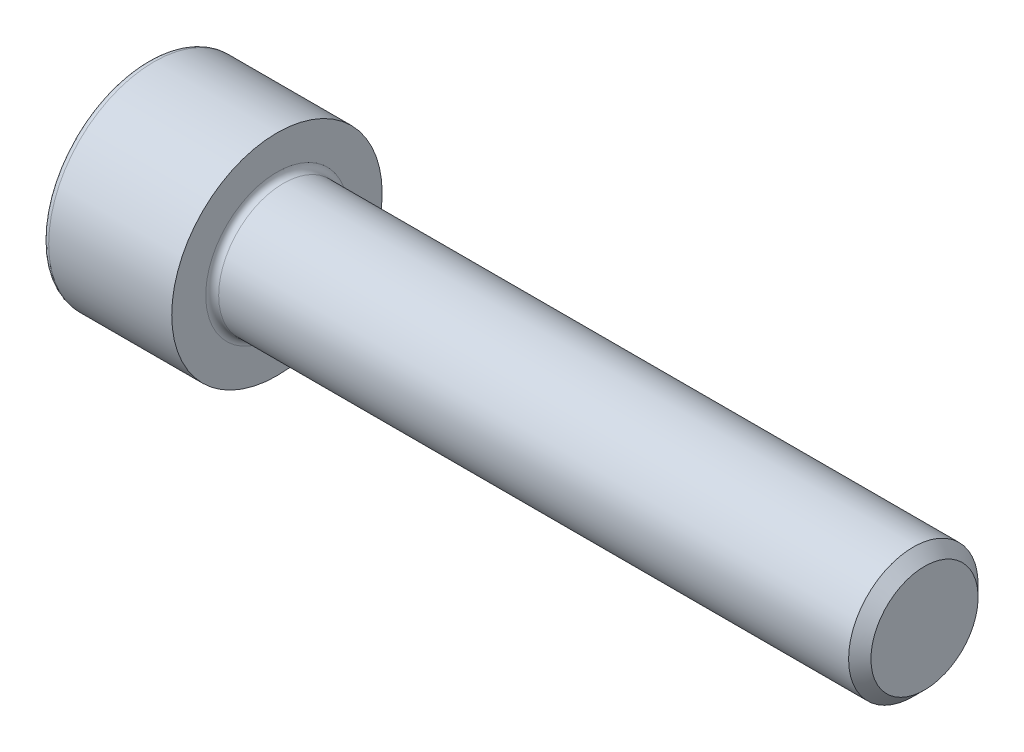
ISO-10303-21;
HEADER;
FILE_DESCRIPTION(('STEP AP214'),'2;1');
FILE_NAME('part.step','',(''),(''),'','','');
FILE_SCHEMA(('AUTOMOTIVE_DESIGN { 1 0 10303 214 1 1 1 1 }'));
ENDSEC;
DATA;
#1=APPLICATION_CONTEXT('core data for automotive mechanical design processes');
#2=APPLICATION_PROTOCOL_DEFINITION('international standard','automotive_design',2000,#1);
#3=PRODUCT_CONTEXT('',#1,'mechanical');
#4=PRODUCT('Part','Part','',(#3));
#5=PRODUCT_RELATED_PRODUCT_CATEGORY('part','',(#4));
#6=PRODUCT_DEFINITION_FORMATION('','',#4);
#7=PRODUCT_DEFINITION_CONTEXT('part definition',#1,'design');
#8=PRODUCT_DEFINITION('design','',#6,#7);
#9=PRODUCT_DEFINITION_SHAPE('','',#8);
#10=(LENGTH_UNIT() NAMED_UNIT(*) SI_UNIT(.MILLI.,.METRE.));
#11=(NAMED_UNIT(*) PLANE_ANGLE_UNIT() SI_UNIT($,.RADIAN.));
#12=(NAMED_UNIT(*) SI_UNIT($,.STERADIAN.) SOLID_ANGLE_UNIT());
#13=UNCERTAINTY_MEASURE_WITH_UNIT(LENGTH_MEASURE(1.E-05),#10,'distance_accuracy_value','');
#14=(GEOMETRIC_REPRESENTATION_CONTEXT(3) GLOBAL_UNCERTAINTY_ASSIGNED_CONTEXT((#13)) GLOBAL_UNIT_ASSIGNED_CONTEXT((#10,
#11,#12)) REPRESENTATION_CONTEXT('',''));
#15=CARTESIAN_POINT('',(0.,0.,0.));
#16=DIRECTION('',(0.,0.,1.));
#17=DIRECTION('',(1.,0.,0.));
#18=AXIS2_PLACEMENT_3D('',#15,#16,#17);
#19=CARTESIAN_POINT('',(0.,0.,0.));
#20=DIRECTION('',(-1.,0.,0.));
#21=DIRECTION('',(0.,0.,1.));
#22=AXIS2_PLACEMENT_3D('',#19,#20,#21);
#23=PLANE('',#22);
#24=DIRECTION('',(0.,-0.499999999999999,0.866025403784439));
#25=VECTOR('',#24,1.);
#26=CARTESIAN_POINT('',(0.,3.51894989071077,0.));
#27=LINE('',#26,#25);
#28=CARTESIAN_POINT('',(0.,3.51894989071077,0.));
#29=VERTEX_POINT('',#28);
#30=CARTESIAN_POINT('',(0.,1.75947494535538,3.0475));
#31=VERTEX_POINT('',#30);
#32=EDGE_CURVE('E258',#29,#31,#27,.T.);
#33=ORIENTED_EDGE('',*,*,#32,.T.);
#34=DIRECTION('',(0.,1.,0.));
#35=VECTOR('',#34,1.);
#36=CARTESIAN_POINT('',(0.,-1.75947494535539,3.0475));
#37=LINE('',#36,#35);
#38=CARTESIAN_POINT('',(0.,-1.75947494535539,3.0475));
#39=VERTEX_POINT('',#38);
#40=EDGE_CURVE('E130',#39,#31,#37,.T.);
#41=ORIENTED_EDGE('',*,*,#40,.F.);
#42=DIRECTION('',(0.,-0.500000000000001,-0.866025403784438));
#43=VECTOR('',#42,1.);
#44=CARTESIAN_POINT('',(0.,-1.75947494535539,3.0475));
#45=LINE('',#44,#43);
#46=CARTESIAN_POINT('',(0.,-3.51894989071077,0.));
#47=VERTEX_POINT('',#46);
#48=EDGE_CURVE('E261',#39,#47,#45,.T.);
#49=ORIENTED_EDGE('',*,*,#48,.T.);
#50=DIRECTION('',(0.,0.499999999999999,-0.866025403784439));
#51=VECTOR('',#50,1.);
#52=CARTESIAN_POINT('',(0.,-3.51894989071077,0.));
#53=LINE('',#52,#51);
#54=CARTESIAN_POINT('',(0.,-1.75947494535539,-3.0475));
#55=VERTEX_POINT('',#54);
#56=EDGE_CURVE('E264',#47,#55,#53,.T.);
#57=ORIENTED_EDGE('',*,*,#56,.T.);
#58=DIRECTION('',(0.,-1.,0.));
#59=VECTOR('',#58,1.);
#60=CARTESIAN_POINT('',(0.,1.75947494535538,-3.04750000000001));
#61=LINE('',#60,#59);
#62=CARTESIAN_POINT('',(0.,1.75947494535538,-3.04750000000001));
#63=VERTEX_POINT('',#62);
#64=EDGE_CURVE('E267',#63,#55,#61,.T.);
#65=ORIENTED_EDGE('',*,*,#64,.F.);
#66=DIRECTION('',(0.,-0.500000000000001,-0.866025403784438));
#67=VECTOR('',#66,1.);
#68=CARTESIAN_POINT('',(0.,3.51894989071077,0.));
#69=LINE('',#68,#67);
#70=EDGE_CURVE('E125',#29,#63,#69,.T.);
#71=ORIENTED_EDGE('',*,*,#70,.F.);
#72=EDGE_LOOP('',(#33,#41,#49,#57,#65,#71));
#73=FACE_BOUND('',#72,.T.);
#74=CARTESIAN_POINT('',(0.,0.,0.));
#75=DIRECTION('',(-1.,0.,0.));
#76=DIRECTION('',(0.,0.,1.));
#77=AXIS2_PLACEMENT_3D('',#74,#75,#76);
#78=CIRCLE('',#77,6.1);
#79=CARTESIAN_POINT('',(0.,0.,6.1));
#80=VERTEX_POINT('',#79);
#81=EDGE_CURVE('E42',#80,#80,#78,.T.);
#82=ORIENTED_EDGE('',*,*,#81,.T.);
#83=EDGE_LOOP('',(#82));
#84=FACE_BOUND('',#83,.T.);
#85=ADVANCED_FACE('F34',(#73,#84),#23,.T.);
#86=CARTESIAN_POINT('',(-31.75,0.,0.));
#87=DIRECTION('',(-1.,0.,0.));
#88=DIRECTION('',(0.,0.,1.));
#89=AXIS2_PLACEMENT_3D('',#86,#87,#88);
#90=CYLINDRICAL_SURFACE('',#89,6.5);
#91=CARTESIAN_POINT('',(0.399999999999998,0.,0.));
#92=DIRECTION('',(-1.,0.,0.));
#93=DIRECTION('',(0.,0.,1.));
#94=AXIS2_PLACEMENT_3D('',#91,#92,#93);
#95=CIRCLE('',#94,6.5);
#96=CARTESIAN_POINT('',(0.399999999999998,0.,6.5));
#97=VERTEX_POINT('',#96);
#98=EDGE_CURVE('E11',#97,#97,#95,.F.);
#99=ORIENTED_EDGE('',*,*,#98,.T.);
#100=EDGE_LOOP('',(#99));
#101=FACE_BOUND('',#100,.T.);
#102=CARTESIAN_POINT('',(8.,0.,0.));
#103=DIRECTION('',(-1.,0.,0.));
#104=DIRECTION('',(0.,0.,1.));
#105=AXIS2_PLACEMENT_3D('',#102,#103,#104);
#106=CIRCLE('',#105,6.5);
#107=CARTESIAN_POINT('',(8.,0.,6.5));
#108=VERTEX_POINT('',#107);
#109=EDGE_CURVE('E148',#108,#108,#106,.T.);
#110=ORIENTED_EDGE('',*,*,#109,.T.);
#111=EDGE_LOOP('',(#110));
#112=FACE_BOUND('',#111,.T.);
#113=ADVANCED_FACE('F172',(#101,#112),#90,.T.);
#114=CARTESIAN_POINT('',(8.,6.5,0.));
#115=DIRECTION('',(1.,0.,0.));
#116=DIRECTION('',(0.,0.,-1.));
#117=AXIS2_PLACEMENT_3D('',#114,#115,#116);
#118=PLANE('',#117);
#119=CARTESIAN_POINT('',(8.,0.,0.));
#120=DIRECTION('',(1.,0.,0.));
#121=DIRECTION('',(0.,0.,-1.));
#122=AXIS2_PLACEMENT_3D('',#119,#120,#121);
#123=CIRCLE('',#122,4.39999999999997);
#124=CARTESIAN_POINT('',(8.,0.,-4.39999999999997));
#125=VERTEX_POINT('',#124);
#126=EDGE_CURVE('E151',#125,#125,#123,.F.);
#127=ORIENTED_EDGE('',*,*,#126,.T.);
#128=EDGE_LOOP('',(#127));
#129=FACE_BOUND('',#128,.T.);
#130=ORIENTED_EDGE('',*,*,#109,.F.);
#131=EDGE_LOOP('',(#130));
#132=FACE_BOUND('',#131,.T.);
#133=ADVANCED_FACE('F178',(#129,#132),#118,.T.);
#134=CARTESIAN_POINT('',(-31.75,0.,0.));
#135=DIRECTION('',(-1.,0.,0.));
#136=DIRECTION('',(0.,0.,1.));
#137=AXIS2_PLACEMENT_3D('',#134,#135,#136);
#138=CYLINDRICAL_SURFACE('',#137,3.99999999999997);
#139=CARTESIAN_POINT('',(8.4,0.,0.));
#140=DIRECTION('',(1.,0.,0.));
#141=DIRECTION('',(0.,0.,-1.));
#142=AXIS2_PLACEMENT_3D('',#139,#140,#141);
#143=CIRCLE('',#142,3.99999999999997);
#144=CARTESIAN_POINT('',(8.4,0.,-3.99999999999997));
#145=VERTEX_POINT('',#144);
#146=EDGE_CURVE('E154',#145,#145,#143,.T.);
#147=ORIENTED_EDGE('',*,*,#146,.T.);
#148=EDGE_LOOP('',(#147));
#149=FACE_BOUND('',#148,.T.);
#150=CARTESIAN_POINT('',(47.3095,0.,0.));
#151=DIRECTION('',(-1.,0.,0.));
#152=DIRECTION('',(0.,0.,1.));
#153=AXIS2_PLACEMENT_3D('',#150,#151,#152);
#154=CIRCLE('',#153,3.99999999999994);
#155=CARTESIAN_POINT('',(47.3095,0.,3.99999999999994));
#156=VERTEX_POINT('',#155);
#157=EDGE_CURVE('E145',#156,#156,#154,.T.);
#158=ORIENTED_EDGE('',*,*,#157,.T.);
#159=EDGE_LOOP('',(#158));
#160=FACE_BOUND('',#159,.T.);
#161=ADVANCED_FACE('F184',(#149,#160),#138,.T.);
#162=CARTESIAN_POINT('',(48.,0.,0.));
#163=DIRECTION('',(-1.,0.,0.));
#164=DIRECTION('',(0.,0.,1.));
#165=AXIS2_PLACEMENT_3D('',#162,#163,#164);
#166=CONICAL_SURFACE('',#165,3.3095,0.785398163397378);
#167=ORIENTED_EDGE('',*,*,#157,.F.);
#168=EDGE_LOOP('',(#167));
#169=FACE_BOUND('',#168,.T.);
#170=CARTESIAN_POINT('',(48.,0.,0.));
#171=DIRECTION('',(-1.,0.,0.));
#172=DIRECTION('',(0.,0.,1.));
#173=AXIS2_PLACEMENT_3D('',#170,#171,#172);
#174=CIRCLE('',#173,3.3095);
#175=CARTESIAN_POINT('',(48.,0.,3.3095));
#176=VERTEX_POINT('',#175);
#177=EDGE_CURVE('E141',#176,#176,#174,.T.);
#178=ORIENTED_EDGE('',*,*,#177,.T.);
#179=EDGE_LOOP('',(#178));
#180=FACE_BOUND('',#179,.T.);
#181=ADVANCED_FACE('F188',(#169,#180),#166,.T.);
#182=CARTESIAN_POINT('',(48.,3.3095,0.));
#183=DIRECTION('',(1.,0.,0.));
#184=DIRECTION('',(0.,0.,-1.));
#185=AXIS2_PLACEMENT_3D('',#182,#183,#184);
#186=PLANE('',#185);
#187=ORIENTED_EDGE('',*,*,#177,.F.);
#188=EDGE_LOOP('',(#187));
#189=FACE_BOUND('',#188,.T.);
#190=ADVANCED_FACE('F168',(#189),#186,.T.);
#191=CARTESIAN_POINT('',(8.4,0.,0.));
#192=DIRECTION('',(1.,0.,0.));
#193=DIRECTION('',(0.,0.,-1.));
#194=AXIS2_PLACEMENT_3D('',#191,#192,#193);
#195=TOROIDAL_SURFACE('',#194,4.39999999999997,0.4);
#196=ORIENTED_EDGE('',*,*,#146,.F.);
#197=EDGE_LOOP('',(#196));
#198=FACE_BOUND('',#197,.T.);
#199=ORIENTED_EDGE('',*,*,#126,.F.);
#200=EDGE_LOOP('',(#199));
#201=FACE_BOUND('',#200,.T.);
#202=ADVANCED_FACE('F161',(#198,#201),#195,.F.);
#203=CARTESIAN_POINT('',(0.399999999999998,0.,0.));
#204=DIRECTION('',(-1.,0.,0.));
#205=DIRECTION('',(0.,0.,1.));
#206=AXIS2_PLACEMENT_3D('',#203,#204,#205);
#207=TOROIDAL_SURFACE('',#206,6.1,0.4);
#208=ORIENTED_EDGE('',*,*,#98,.F.);
#209=EDGE_LOOP('',(#208));
#210=FACE_BOUND('',#209,.T.);
#211=ORIENTED_EDGE('',*,*,#81,.F.);
#212=EDGE_LOOP('',(#211));
#213=FACE_BOUND('',#212,.T.);
#214=ADVANCED_FACE('F36',(#210,#213),#207,.T.);
#215=CARTESIAN_POINT('',(4.,3.51894989071077,0.));
#216=DIRECTION('',(0.,-0.866025403784439,-0.499999999999999));
#217=DIRECTION('',(0.,0.499999999999999,-0.866025403784439));
#218=AXIS2_PLACEMENT_3D('',#215,#216,#217);
#219=PLANE('',#218);
#220=ORIENTED_EDGE('',*,*,#32,.F.);
#221=DIRECTION('',(-1.,0.,0.));
#222=VECTOR('',#221,1.);
#223=CARTESIAN_POINT('',(4.,3.51894989071077,0.));
#224=LINE('',#223,#222);
#225=CARTESIAN_POINT('',(4.,3.51894989071077,0.));
#226=VERTEX_POINT('',#225);
#227=EDGE_CURVE('E248',#226,#29,#224,.T.);
#228=ORIENTED_EDGE('',*,*,#227,.F.);
#229=DIRECTION('',(0.,-0.499999999999999,0.866025403784439));
#230=VECTOR('',#229,1.);
#231=CARTESIAN_POINT('',(4.,3.51894989071077,0.));
#232=LINE('',#231,#230);
#233=CARTESIAN_POINT('',(4.,2.63921241803308,1.52375));
#234=VERTEX_POINT('',#233);
#235=EDGE_CURVE('E117',#226,#234,#232,.T.);
#236=ORIENTED_EDGE('',*,*,#235,.T.);
#237=CARTESIAN_POINT('',(4.,1.75947494535538,3.0475));
#238=VERTEX_POINT('',#237);
#239=EDGE_CURVE('E108',#234,#238,#232,.T.);
#240=ORIENTED_EDGE('',*,*,#239,.T.);
#241=DIRECTION('',(-1.,0.,0.));
#242=VECTOR('',#241,1.);
#243=CARTESIAN_POINT('',(4.,1.75947494535538,3.0475));
#244=LINE('',#243,#242);
#245=EDGE_CURVE('E122',#238,#31,#244,.T.);
#246=ORIENTED_EDGE('',*,*,#245,.T.);
#247=EDGE_LOOP('',(#220,#228,#236,#240,#246));
#248=FACE_BOUND('',#247,.T.);
#249=ADVANCED_FACE('F121',(#248),#219,.T.);
#250=CARTESIAN_POINT('',(4.,-1.75947494535539,3.0475));
#251=DIRECTION('',(0.,0.,1.));
#252=DIRECTION('',(0.,-1.,0.));
#253=AXIS2_PLACEMENT_3D('',#250,#251,#252);
#254=PLANE('',#253);
#255=ORIENTED_EDGE('',*,*,#40,.T.);
#256=ORIENTED_EDGE('',*,*,#245,.F.);
#257=DIRECTION('',(0.,1.,0.));
#258=VECTOR('',#257,1.);
#259=CARTESIAN_POINT('',(4.,-1.75947494535539,3.0475));
#260=LINE('',#259,#258);
#261=CARTESIAN_POINT('',(4.,0.,3.0475));
#262=VERTEX_POINT('',#261);
#263=EDGE_CURVE('E105',#262,#238,#260,.T.);
#264=ORIENTED_EDGE('',*,*,#263,.F.);
#265=CARTESIAN_POINT('',(4.,-1.75947494535539,3.0475));
#266=VERTEX_POINT('',#265);
#267=EDGE_CURVE('E116',#266,#262,#260,.T.);
#268=ORIENTED_EDGE('',*,*,#267,.F.);
#269=DIRECTION('',(-1.,0.,0.));
#270=VECTOR('',#269,1.);
#271=CARTESIAN_POINT('',(4.,-1.75947494535539,3.0475));
#272=LINE('',#271,#270);
#273=EDGE_CURVE('E132',#266,#39,#272,.T.);
#274=ORIENTED_EDGE('',*,*,#273,.T.);
#275=EDGE_LOOP('',(#255,#256,#264,#268,#274));
#276=FACE_BOUND('',#275,.T.);
#277=ADVANCED_FACE('F127',(#276),#254,.F.);
#278=CARTESIAN_POINT('',(4.,-1.75947494535539,3.0475));
#279=DIRECTION('',(0.,0.866025403784438,-0.500000000000001));
#280=DIRECTION('',(0.,0.500000000000001,0.866025403784438));
#281=AXIS2_PLACEMENT_3D('',#278,#279,#280);
#282=PLANE('',#281);
#283=ORIENTED_EDGE('',*,*,#48,.F.);
#284=ORIENTED_EDGE('',*,*,#273,.F.);
#285=DIRECTION('',(0.,-0.500000000000001,-0.866025403784438));
#286=VECTOR('',#285,1.);
#287=CARTESIAN_POINT('',(4.,-1.75947494535539,3.0475));
#288=LINE('',#287,#286);
#289=CARTESIAN_POINT('',(4.,-2.63921241803308,1.52375));
#290=VERTEX_POINT('',#289);
#291=EDGE_CURVE('E287',#266,#290,#288,.T.);
#292=ORIENTED_EDGE('',*,*,#291,.T.);
#293=CARTESIAN_POINT('',(4.,-3.51894989071077,0.));
#294=VERTEX_POINT('',#293);
#295=EDGE_CURVE('E276',#290,#294,#288,.T.);
#296=ORIENTED_EDGE('',*,*,#295,.T.);
#297=DIRECTION('',(-1.,0.,0.));
#298=VECTOR('',#297,1.);
#299=CARTESIAN_POINT('',(4.,-3.51894989071077,0.));
#300=LINE('',#299,#298);
#301=EDGE_CURVE('E137',#294,#47,#300,.T.);
#302=ORIENTED_EDGE('',*,*,#301,.T.);
#303=EDGE_LOOP('',(#283,#284,#292,#296,#302));
#304=FACE_BOUND('',#303,.T.);
#305=ADVANCED_FACE('F202',(#304),#282,.T.);
#306=CARTESIAN_POINT('',(4.,-3.51894989071077,0.));
#307=DIRECTION('',(0.,0.866025403784439,0.499999999999999));
#308=DIRECTION('',(0.,-0.499999999999999,0.866025403784439));
#309=AXIS2_PLACEMENT_3D('',#306,#307,#308);
#310=PLANE('',#309);
#311=ORIENTED_EDGE('',*,*,#56,.F.);
#312=ORIENTED_EDGE('',*,*,#301,.F.);
#313=DIRECTION('',(0.,0.499999999999999,-0.866025403784439));
#314=VECTOR('',#313,1.);
#315=CARTESIAN_POINT('',(4.,-3.51894989071077,0.));
#316=LINE('',#315,#314);
#317=CARTESIAN_POINT('',(4.,-2.63921241803308,-1.52375));
#318=VERTEX_POINT('',#317);
#319=EDGE_CURVE('E254',#294,#318,#316,.T.);
#320=ORIENTED_EDGE('',*,*,#319,.T.);
#321=CARTESIAN_POINT('',(4.,-1.75947494535539,-3.0475));
#322=VERTEX_POINT('',#321);
#323=EDGE_CURVE('E286',#318,#322,#316,.T.);
#324=ORIENTED_EDGE('',*,*,#323,.T.);
#325=DIRECTION('',(-1.,0.,0.));
#326=VECTOR('',#325,1.);
#327=CARTESIAN_POINT('',(4.,-1.75947494535539,-3.0475));
#328=LINE('',#327,#326);
#329=EDGE_CURVE('E247',#322,#55,#328,.T.);
#330=ORIENTED_EDGE('',*,*,#329,.T.);
#331=EDGE_LOOP('',(#311,#312,#320,#324,#330));
#332=FACE_BOUND('',#331,.T.);
#333=ADVANCED_FACE('F205',(#332),#310,.T.);
#334=CARTESIAN_POINT('',(4.,1.75947494535538,-3.04750000000001));
#335=DIRECTION('',(0.,0.,-1.));
#336=DIRECTION('',(0.,1.,0.));
#337=AXIS2_PLACEMENT_3D('',#334,#335,#336);
#338=PLANE('',#337);
#339=ORIENTED_EDGE('',*,*,#64,.T.);
#340=ORIENTED_EDGE('',*,*,#329,.F.);
#341=DIRECTION('',(0.,-1.,0.));
#342=VECTOR('',#341,1.);
#343=CARTESIAN_POINT('',(4.,1.75947494535538,-3.04750000000001));
#344=LINE('',#343,#342);
#345=CARTESIAN_POINT('',(4.,0.,-3.0475));
#346=VERTEX_POINT('',#345);
#347=EDGE_CURVE('E251',#346,#322,#344,.T.);
#348=ORIENTED_EDGE('',*,*,#347,.F.);
#349=CARTESIAN_POINT('',(4.,1.75947494535538,-3.04750000000001));
#350=VERTEX_POINT('',#349);
#351=EDGE_CURVE('E49',#350,#346,#344,.T.);
#352=ORIENTED_EDGE('',*,*,#351,.F.);
#353=DIRECTION('',(-1.,0.,0.));
#354=VECTOR('',#353,1.);
#355=CARTESIAN_POINT('',(4.,1.75947494535538,-3.04750000000001));
#356=LINE('',#355,#354);
#357=EDGE_CURVE('E244',#350,#63,#356,.T.);
#358=ORIENTED_EDGE('',*,*,#357,.T.);
#359=EDGE_LOOP('',(#339,#340,#348,#352,#358));
#360=FACE_BOUND('',#359,.T.);
#361=ADVANCED_FACE('F209',(#360),#338,.F.);
#362=CARTESIAN_POINT('',(4.,3.51894989071077,0.));
#363=DIRECTION('',(0.,0.866025403784438,-0.500000000000001));
#364=DIRECTION('',(0.,0.500000000000001,0.866025403784438));
#365=AXIS2_PLACEMENT_3D('',#362,#363,#364);
#366=PLANE('',#365);
#367=ORIENTED_EDGE('',*,*,#70,.T.);
#368=ORIENTED_EDGE('',*,*,#357,.F.);
#369=DIRECTION('',(0.,-0.500000000000001,-0.866025403784438));
#370=VECTOR('',#369,1.);
#371=CARTESIAN_POINT('',(4.,3.51894989071077,0.));
#372=LINE('',#371,#370);
#373=CARTESIAN_POINT('',(4.,2.63921241803307,-1.52375));
#374=VERTEX_POINT('',#373);
#375=EDGE_CURVE('E234',#374,#350,#372,.T.);
#376=ORIENTED_EDGE('',*,*,#375,.F.);
#377=EDGE_CURVE('E240',#226,#374,#372,.T.);
#378=ORIENTED_EDGE('',*,*,#377,.F.);
#379=ORIENTED_EDGE('',*,*,#227,.T.);
#380=EDGE_LOOP('',(#367,#368,#376,#378,#379));
#381=FACE_BOUND('',#380,.T.);
#382=ADVANCED_FACE('F213',(#381),#366,.F.);
#383=CARTESIAN_POINT('',(4.,3.51894989071077,0.));
#384=DIRECTION('',(1.,0.,0.));
#385=DIRECTION('',(0.,0.,-1.));
#386=AXIS2_PLACEMENT_3D('',#383,#384,#385);
#387=PLANE('',#386);
#388=ORIENTED_EDGE('',*,*,#347,.T.);
#389=ORIENTED_EDGE('',*,*,#323,.F.);
#390=CARTESIAN_POINT('',(4.,0.,0.));
#391=DIRECTION('',(-1.,0.,0.));
#392=DIRECTION('',(0.,0.,1.));
#393=AXIS2_PLACEMENT_3D('',#390,#391,#392);
#394=CIRCLE('',#393,3.0475);
#395=EDGE_CURVE('E282',#346,#318,#394,.T.);
#396=ORIENTED_EDGE('',*,*,#395,.F.);
#397=EDGE_LOOP('',(#388,#389,#396));
#398=FACE_BOUND('',#397,.T.);
#399=ADVANCED_FACE('F217',(#398),#387,.F.);
#400=ORIENTED_EDGE('',*,*,#319,.F.);
#401=ORIENTED_EDGE('',*,*,#295,.F.);
#402=EDGE_CURVE('E135',#318,#290,#394,.T.);
#403=ORIENTED_EDGE('',*,*,#402,.F.);
#404=EDGE_LOOP('',(#400,#401,#403));
#405=FACE_BOUND('',#404,.T.);
#406=ADVANCED_FACE('F220',(#405),#387,.F.);
#407=ORIENTED_EDGE('',*,*,#291,.F.);
#408=ORIENTED_EDGE('',*,*,#267,.T.);
#409=EDGE_CURVE('E131',#290,#262,#394,.T.);
#410=ORIENTED_EDGE('',*,*,#409,.F.);
#411=EDGE_LOOP('',(#407,#408,#410));
#412=FACE_BOUND('',#411,.T.);
#413=ADVANCED_FACE('F225',(#412),#387,.F.);
#414=ORIENTED_EDGE('',*,*,#263,.T.);
#415=ORIENTED_EDGE('',*,*,#239,.F.);
#416=EDGE_CURVE('E111',#262,#234,#394,.T.);
#417=ORIENTED_EDGE('',*,*,#416,.F.);
#418=EDGE_LOOP('',(#414,#415,#417));
#419=FACE_BOUND('',#418,.T.);
#420=ADVANCED_FACE('F107',(#419),#387,.F.);
#421=ORIENTED_EDGE('',*,*,#235,.F.);
#422=ORIENTED_EDGE('',*,*,#377,.T.);
#423=EDGE_CURVE('E142',#234,#374,#394,.T.);
#424=ORIENTED_EDGE('',*,*,#423,.F.);
#425=EDGE_LOOP('',(#421,#422,#424));
#426=FACE_BOUND('',#425,.T.);
#427=ADVANCED_FACE('F228',(#426),#387,.F.);
#428=ORIENTED_EDGE('',*,*,#375,.T.);
#429=ORIENTED_EDGE('',*,*,#351,.T.);
#430=EDGE_CURVE('E237',#374,#346,#394,.T.);
#431=ORIENTED_EDGE('',*,*,#430,.F.);
#432=EDGE_LOOP('',(#428,#429,#431));
#433=FACE_BOUND('',#432,.T.);
#434=ADVANCED_FACE('F198',(#433),#387,.F.);
#435=CARTESIAN_POINT('',(4.,0.,0.));
#436=DIRECTION('',(-1.,0.,0.));
#437=DIRECTION('',(0.,0.,1.));
#438=AXIS2_PLACEMENT_3D('',#435,#436,#437);
#439=CONICAL_SURFACE('',#438,3.0475,1.04719755119659);
#440=CARTESIAN_POINT('',(5.75947494535541,0.,0.));
#441=VERTEX_POINT('',#440);
#442=VERTEX_LOOP('',#441);
#443=FACE_BOUND('',#442,.T.);
#444=ORIENTED_EDGE('',*,*,#416,.T.);
#445=ORIENTED_EDGE('',*,*,#423,.T.);
#446=ORIENTED_EDGE('',*,*,#430,.T.);
#447=ORIENTED_EDGE('',*,*,#395,.T.);
#448=ORIENTED_EDGE('',*,*,#402,.T.);
#449=ORIENTED_EDGE('',*,*,#409,.T.);
#450=EDGE_LOOP('',(#444,#445,#446,#447,#448,#449));
#451=FACE_BOUND('',#450,.T.);
#452=ADVANCED_FACE('F196',(#443,#451),#439,.F.);
#453=CLOSED_SHELL('',(#85,#113,#133,#161,#181,#190,#202,#214,#249,#277,#305,#333,#361,#382,#399,
#406,#413,#420,#427,#434,#452));
#454=MANIFOLD_SOLID_BREP('B2',#453);
#455=ADVANCED_BREP_SHAPE_REPRESENTATION('',(#18,#454),#14);
#456=SHAPE_DEFINITION_REPRESENTATION(#9,#455);
ENDSEC;
END-ISO-10303-21;
